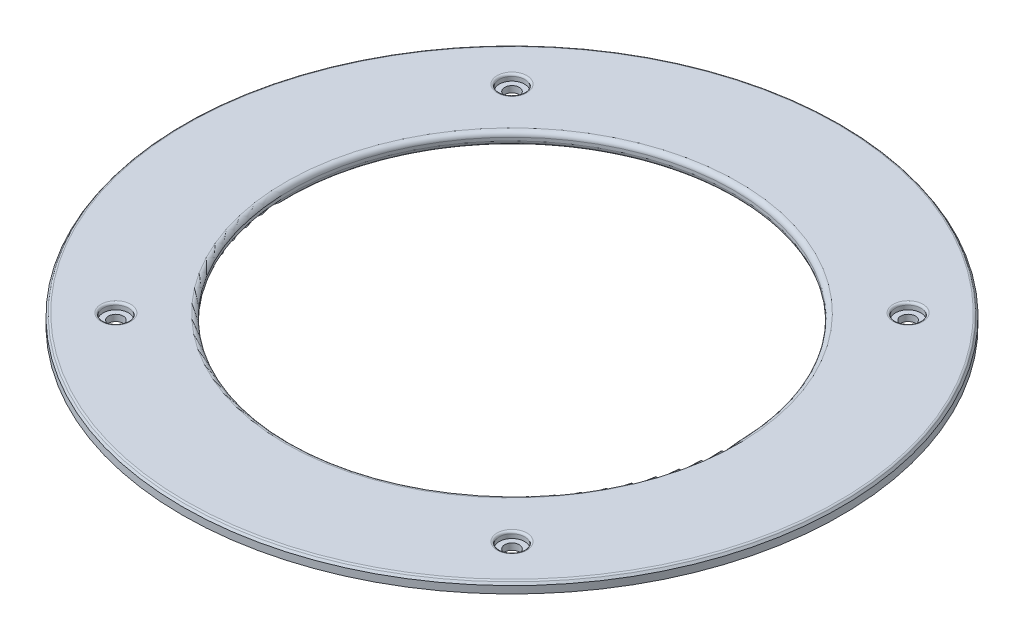
ISO-10303-21;
HEADER;
FILE_DESCRIPTION(('STEP AP214'),'2;1');
FILE_NAME('part.step','',(''),(''),'','','');
FILE_SCHEMA(('AUTOMOTIVE_DESIGN { 1 0 10303 214 1 1 1 1 }'));
ENDSEC;
DATA;
#1=APPLICATION_CONTEXT('core data for automotive mechanical design processes');
#2=APPLICATION_PROTOCOL_DEFINITION('international standard','automotive_design',2000,#1);
#3=PRODUCT_CONTEXT('',#1,'mechanical');
#4=PRODUCT('Part','Part','',(#3));
#5=PRODUCT_RELATED_PRODUCT_CATEGORY('part','',(#4));
#6=PRODUCT_DEFINITION_FORMATION('','',#4);
#7=PRODUCT_DEFINITION_CONTEXT('part definition',#1,'design');
#8=PRODUCT_DEFINITION('design','',#6,#7);
#9=PRODUCT_DEFINITION_SHAPE('','',#8);
#10=(LENGTH_UNIT() NAMED_UNIT(*) SI_UNIT(.MILLI.,.METRE.));
#11=(NAMED_UNIT(*) PLANE_ANGLE_UNIT() SI_UNIT($,.RADIAN.));
#12=(NAMED_UNIT(*) SI_UNIT($,.STERADIAN.) SOLID_ANGLE_UNIT());
#13=UNCERTAINTY_MEASURE_WITH_UNIT(LENGTH_MEASURE(1.E-05),#10,'distance_accuracy_value','');
#14=(GEOMETRIC_REPRESENTATION_CONTEXT(3) GLOBAL_UNCERTAINTY_ASSIGNED_CONTEXT((#13)) GLOBAL_UNIT_ASSIGNED_CONTEXT((#10,
#11,#12)) REPRESENTATION_CONTEXT('',''));
#15=CARTESIAN_POINT('',(0.,0.,0.));
#16=DIRECTION('',(0.,0.,1.));
#17=DIRECTION('',(1.,0.,0.));
#18=AXIS2_PLACEMENT_3D('',#15,#16,#17);
#19=CARTESIAN_POINT('',(0.,4.,0.));
#20=DIRECTION('',(0.,-1.,0.));
#21=DIRECTION('',(0.,0.,-1.));
#22=AXIS2_PLACEMENT_3D('',#19,#20,#21);
#23=CYLINDRICAL_SURFACE('',#22,104.);
#24=CARTESIAN_POINT('',(0.,0.700207538209707,0.));
#25=DIRECTION('',(0.,1.,0.));
#26=DIRECTION('',(0.,0.,1.));
#27=AXIS2_PLACEMENT_3D('',#24,#25,#26);
#28=CIRCLE('',#27,104.);
#29=CARTESIAN_POINT('',(0.,0.700207538209707,104.));
#30=VERTEX_POINT('',#29);
#31=EDGE_CURVE('E89',#30,#30,#28,.T.);
#32=ORIENTED_EDGE('',*,*,#31,.T.);
#33=EDGE_LOOP('',(#32));
#34=FACE_BOUND('',#33,.T.);
#35=CARTESIAN_POINT('',(0.,2.99999999999997,0.));
#36=DIRECTION('',(0.,1.,0.));
#37=DIRECTION('',(0.,0.,1.));
#38=AXIS2_PLACEMENT_3D('',#35,#36,#37);
#39=CIRCLE('',#38,104.);
#40=CARTESIAN_POINT('',(0.,2.99999999999997,104.));
#41=VERTEX_POINT('',#40);
#42=EDGE_CURVE('E92',#41,#41,#39,.F.);
#43=ORIENTED_EDGE('',*,*,#42,.T.);
#44=EDGE_LOOP('',(#43));
#45=FACE_BOUND('',#44,.T.);
#46=ADVANCED_FACE('F45',(#34,#45),#23,.T.);
#47=CARTESIAN_POINT('',(0.,4.,0.));
#48=DIRECTION('',(0.,1.,0.));
#49=DIRECTION('',(0.,0.,1.));
#50=AXIS2_PLACEMENT_3D('',#47,#48,#49);
#51=PLANE('',#50);
#52=CARTESIAN_POINT('',(0.,4.,0.));
#53=DIRECTION('',(0.,1.,0.));
#54=DIRECTION('',(0.,0.,1.));
#55=AXIS2_PLACEMENT_3D('',#52,#53,#54);
#56=CIRCLE('',#55,102.935395526404);
#57=CARTESIAN_POINT('',(0.,4.,102.935395526404));
#58=VERTEX_POINT('',#57);
#59=EDGE_CURVE('E52',#58,#58,#56,.T.);
#60=ORIENTED_EDGE('',*,*,#59,.T.);
#61=EDGE_LOOP('',(#60));
#62=FACE_BOUND('',#61,.T.);
#63=CARTESIAN_POINT('',(-62.5,4.,62.5));
#64=DIRECTION('',(0.,1.,0.));
#65=DIRECTION('',(0.,0.,1.));
#66=AXIS2_PLACEMENT_3D('',#63,#64,#65);
#67=CIRCLE('',#66,4.7);
#68=CARTESIAN_POINT('',(-62.5,4.,67.2));
#69=VERTEX_POINT('',#68);
#70=EDGE_CURVE('E74',#69,#69,#67,.F.);
#71=ORIENTED_EDGE('',*,*,#70,.T.);
#72=EDGE_LOOP('',(#71));
#73=FACE_BOUND('',#72,.T.);
#74=CARTESIAN_POINT('',(-62.5,4.,-62.5));
#75=DIRECTION('',(0.,1.,0.));
#76=DIRECTION('',(0.,0.,1.));
#77=AXIS2_PLACEMENT_3D('',#74,#75,#76);
#78=CIRCLE('',#77,4.7);
#79=CARTESIAN_POINT('',(-62.5,4.,-57.8));
#80=VERTEX_POINT('',#79);
#81=EDGE_CURVE('E77',#80,#80,#78,.F.);
#82=ORIENTED_EDGE('',*,*,#81,.T.);
#83=EDGE_LOOP('',(#82));
#84=FACE_BOUND('',#83,.T.);
#85=CARTESIAN_POINT('',(62.5,4.,-62.5));
#86=DIRECTION('',(0.,1.,0.));
#87=DIRECTION('',(0.,0.,1.));
#88=AXIS2_PLACEMENT_3D('',#85,#86,#87);
#89=CIRCLE('',#88,4.7);
#90=CARTESIAN_POINT('',(62.5,4.,-57.8));
#91=VERTEX_POINT('',#90);
#92=EDGE_CURVE('E80',#91,#91,#89,.F.);
#93=ORIENTED_EDGE('',*,*,#92,.T.);
#94=EDGE_LOOP('',(#93));
#95=FACE_BOUND('',#94,.T.);
#96=CARTESIAN_POINT('',(62.5,4.,62.5));
#97=DIRECTION('',(0.,1.,0.));
#98=DIRECTION('',(0.,0.,1.));
#99=AXIS2_PLACEMENT_3D('',#96,#97,#98);
#100=CIRCLE('',#99,4.7);
#101=CARTESIAN_POINT('',(62.5,4.,67.2));
#102=VERTEX_POINT('',#101);
#103=EDGE_CURVE('E83',#102,#102,#100,.F.);
#104=ORIENTED_EDGE('',*,*,#103,.T.);
#105=EDGE_LOOP('',(#104));
#106=FACE_BOUND('',#105,.T.);
#107=CARTESIAN_POINT('',(0.,4.,0.));
#108=DIRECTION('',(0.,1.,0.));
#109=DIRECTION('',(0.,0.,1.));
#110=AXIS2_PLACEMENT_3D('',#107,#108,#109);
#111=CIRCLE('',#110,71.5);
#112=CARTESIAN_POINT('',(0.,4.,71.5000000000001));
#113=VERTEX_POINT('',#112);
#114=EDGE_CURVE('E98',#113,#113,#111,.F.);
#115=ORIENTED_EDGE('',*,*,#114,.T.);
#116=EDGE_LOOP('',(#115));
#117=FACE_BOUND('',#116,.T.);
#118=ADVANCED_FACE('F164',(#62,#73,#84,#95,#106,#117),#51,.T.);
#119=CARTESIAN_POINT('',(0.,0.,0.));
#120=DIRECTION('',(0.,1.,0.));
#121=DIRECTION('',(0.,0.,1.));
#122=AXIS2_PLACEMENT_3D('',#119,#120,#121);
#123=PLANE('',#122);
#124=CARTESIAN_POINT('',(0.,0.,0.));
#125=DIRECTION('',(0.,1.,0.));
#126=DIRECTION('',(0.,0.,1.));
#127=AXIS2_PLACEMENT_3D('',#124,#125,#126);
#128=CIRCLE('',#127,102.779290847785);
#129=CARTESIAN_POINT('',(0.,0.,102.779290847785));
#130=VERTEX_POINT('',#129);
#131=EDGE_CURVE('E60',#130,#130,#128,.F.);
#132=ORIENTED_EDGE('',*,*,#131,.T.);
#133=EDGE_LOOP('',(#132));
#134=FACE_BOUND('',#133,.T.);
#135=CARTESIAN_POINT('',(0.,0.,0.));
#136=DIRECTION('',(0.,1.,0.));
#137=DIRECTION('',(0.,0.,1.));
#138=AXIS2_PLACEMENT_3D('',#135,#136,#137);
#139=CIRCLE('',#138,71.5);
#140=CARTESIAN_POINT('',(0.,0.,71.5000000000001));
#141=VERTEX_POINT('',#140);
#142=EDGE_CURVE('E95',#141,#141,#139,.T.);
#143=ORIENTED_EDGE('',*,*,#142,.T.);
#144=EDGE_LOOP('',(#143));
#145=FACE_BOUND('',#144,.T.);
#146=CARTESIAN_POINT('',(-62.5,0.,-62.5));
#147=DIRECTION('',(0.,1.,0.));
#148=DIRECTION('',(0.,0.,1.));
#149=AXIS2_PLACEMENT_3D('',#146,#147,#148);
#150=CIRCLE('',#149,2.3);
#151=CARTESIAN_POINT('',(-62.5,0.,-60.2));
#152=VERTEX_POINT('',#151);
#153=EDGE_CURVE('E134',#152,#152,#150,.T.);
#154=ORIENTED_EDGE('',*,*,#153,.T.);
#155=EDGE_LOOP('',(#154));
#156=FACE_BOUND('',#155,.T.);
#157=CARTESIAN_POINT('',(62.5,0.,-62.5));
#158=DIRECTION('',(0.,1.,0.));
#159=DIRECTION('',(0.,0.,1.));
#160=AXIS2_PLACEMENT_3D('',#157,#158,#159);
#161=CIRCLE('',#160,2.3);
#162=CARTESIAN_POINT('',(62.5,0.,-60.2));
#163=VERTEX_POINT('',#162);
#164=EDGE_CURVE('E125',#163,#163,#161,.T.);
#165=ORIENTED_EDGE('',*,*,#164,.T.);
#166=EDGE_LOOP('',(#165));
#167=FACE_BOUND('',#166,.T.);
#168=CARTESIAN_POINT('',(62.5,0.,62.5));
#169=DIRECTION('',(0.,1.,0.));
#170=DIRECTION('',(0.,0.,1.));
#171=AXIS2_PLACEMENT_3D('',#168,#169,#170);
#172=CIRCLE('',#171,2.3);
#173=CARTESIAN_POINT('',(62.5,0.,64.8));
#174=VERTEX_POINT('',#173);
#175=EDGE_CURVE('E116',#174,#174,#172,.T.);
#176=ORIENTED_EDGE('',*,*,#175,.T.);
#177=EDGE_LOOP('',(#176));
#178=FACE_BOUND('',#177,.T.);
#179=CARTESIAN_POINT('',(-62.5,0.,62.5));
#180=DIRECTION('',(0.,1.,0.));
#181=DIRECTION('',(0.,0.,1.));
#182=AXIS2_PLACEMENT_3D('',#179,#180,#181);
#183=CIRCLE('',#182,2.3);
#184=CARTESIAN_POINT('',(-62.5,0.,64.8));
#185=VERTEX_POINT('',#184);
#186=EDGE_CURVE('E107',#185,#185,#183,.T.);
#187=ORIENTED_EDGE('',*,*,#186,.T.);
#188=EDGE_LOOP('',(#187));
#189=FACE_BOUND('',#188,.T.);
#190=ADVANCED_FACE('F172',(#134,#145,#156,#167,#178,#189),#123,.F.);
#191=CARTESIAN_POINT('',(-62.5,4.,62.5));
#192=DIRECTION('',(0.,1.,0.));
#193=DIRECTION('',(0.,0.,1.));
#194=AXIS2_PLACEMENT_3D('',#191,#192,#193);
#195=CYLINDRICAL_SURFACE('',#194,2.3);
#196=ORIENTED_EDGE('',*,*,#186,.F.);
#197=EDGE_LOOP('',(#196));
#198=FACE_BOUND('',#197,.T.);
#199=CARTESIAN_POINT('',(-62.5,2.,62.5));
#200=DIRECTION('',(0.,1.,0.));
#201=DIRECTION('',(0.,0.,1.));
#202=AXIS2_PLACEMENT_3D('',#199,#200,#201);
#203=CIRCLE('',#202,2.3);
#204=CARTESIAN_POINT('',(-62.5,2.,64.8));
#205=VERTEX_POINT('',#204);
#206=EDGE_CURVE('E110',#205,#205,#203,.T.);
#207=ORIENTED_EDGE('',*,*,#206,.T.);
#208=EDGE_LOOP('',(#207));
#209=FACE_BOUND('',#208,.T.);
#210=ADVANCED_FACE('F223',(#198,#209),#195,.F.);
#211=CARTESIAN_POINT('',(-60.2,2.,62.5));
#212=DIRECTION('',(0.,-1.,0.));
#213=DIRECTION('',(0.,0.,-1.));
#214=AXIS2_PLACEMENT_3D('',#211,#212,#213);
#215=PLANE('',#214);
#216=ORIENTED_EDGE('',*,*,#206,.F.);
#217=EDGE_LOOP('',(#216));
#218=FACE_BOUND('',#217,.T.);
#219=CARTESIAN_POINT('',(-62.5,2.,62.5));
#220=DIRECTION('',(0.,1.,0.));
#221=DIRECTION('',(0.,0.,1.));
#222=AXIS2_PLACEMENT_3D('',#219,#220,#221);
#223=CIRCLE('',#222,4.);
#224=CARTESIAN_POINT('',(-62.5,2.,66.5));
#225=VERTEX_POINT('',#224);
#226=EDGE_CURVE('E113',#225,#225,#223,.T.);
#227=ORIENTED_EDGE('',*,*,#226,.T.);
#228=EDGE_LOOP('',(#227));
#229=FACE_BOUND('',#228,.T.);
#230=ADVANCED_FACE('F236',(#218,#229),#215,.F.);
#231=CARTESIAN_POINT('',(-62.5,4.,62.5));
#232=DIRECTION('',(0.,1.,0.));
#233=DIRECTION('',(0.,0.,1.));
#234=AXIS2_PLACEMENT_3D('',#231,#232,#233);
#235=CYLINDRICAL_SURFACE('',#234,4.);
#236=CARTESIAN_POINT('',(-62.5,3.3,62.5));
#237=DIRECTION('',(0.,1.,0.));
#238=DIRECTION('',(0.,0.,1.));
#239=AXIS2_PLACEMENT_3D('',#236,#237,#238);
#240=CIRCLE('',#239,4.);
#241=CARTESIAN_POINT('',(-62.5,3.3,66.5));
#242=VERTEX_POINT('',#241);
#243=EDGE_CURVE('E86',#242,#242,#240,.T.);
#244=ORIENTED_EDGE('',*,*,#243,.T.);
#245=EDGE_LOOP('',(#244));
#246=FACE_BOUND('',#245,.T.);
#247=ORIENTED_EDGE('',*,*,#226,.F.);
#248=EDGE_LOOP('',(#247));
#249=FACE_BOUND('',#248,.T.);
#250=ADVANCED_FACE('F242',(#246,#249),#235,.F.);
#251=CARTESIAN_POINT('',(62.5,4.,62.5));
#252=DIRECTION('',(0.,1.,0.));
#253=DIRECTION('',(0.,0.,1.));
#254=AXIS2_PLACEMENT_3D('',#251,#252,#253);
#255=CYLINDRICAL_SURFACE('',#254,2.3);
#256=ORIENTED_EDGE('',*,*,#175,.F.);
#257=EDGE_LOOP('',(#256));
#258=FACE_BOUND('',#257,.T.);
#259=CARTESIAN_POINT('',(62.5,2.,62.5));
#260=DIRECTION('',(0.,1.,0.));
#261=DIRECTION('',(0.,0.,1.));
#262=AXIS2_PLACEMENT_3D('',#259,#260,#261);
#263=CIRCLE('',#262,2.3);
#264=CARTESIAN_POINT('',(62.5,2.,64.8));
#265=VERTEX_POINT('',#264);
#266=EDGE_CURVE('E119',#265,#265,#263,.T.);
#267=ORIENTED_EDGE('',*,*,#266,.T.);
#268=EDGE_LOOP('',(#267));
#269=FACE_BOUND('',#268,.T.);
#270=ADVANCED_FACE('F246',(#258,#269),#255,.F.);
#271=CARTESIAN_POINT('',(64.8,2.,62.5));
#272=DIRECTION('',(0.,-1.,0.));
#273=DIRECTION('',(0.,0.,-1.));
#274=AXIS2_PLACEMENT_3D('',#271,#272,#273);
#275=PLANE('',#274);
#276=ORIENTED_EDGE('',*,*,#266,.F.);
#277=EDGE_LOOP('',(#276));
#278=FACE_BOUND('',#277,.T.);
#279=CARTESIAN_POINT('',(62.5,2.,62.5));
#280=DIRECTION('',(0.,1.,0.));
#281=DIRECTION('',(0.,0.,1.));
#282=AXIS2_PLACEMENT_3D('',#279,#280,#281);
#283=CIRCLE('',#282,4.);
#284=CARTESIAN_POINT('',(62.5,2.,66.5));
#285=VERTEX_POINT('',#284);
#286=EDGE_CURVE('E122',#285,#285,#283,.T.);
#287=ORIENTED_EDGE('',*,*,#286,.T.);
#288=EDGE_LOOP('',(#287));
#289=FACE_BOUND('',#288,.T.);
#290=ADVANCED_FACE('F253',(#278,#289),#275,.F.);
#291=CARTESIAN_POINT('',(62.5,4.,62.5));
#292=DIRECTION('',(0.,1.,0.));
#293=DIRECTION('',(0.,0.,1.));
#294=AXIS2_PLACEMENT_3D('',#291,#292,#293);
#295=CYLINDRICAL_SURFACE('',#294,4.);
#296=CARTESIAN_POINT('',(62.5,3.3,62.5));
#297=DIRECTION('',(0.,1.,0.));
#298=DIRECTION('',(0.,0.,1.));
#299=AXIS2_PLACEMENT_3D('',#296,#297,#298);
#300=CIRCLE('',#299,4.);
#301=CARTESIAN_POINT('',(62.5,3.3,66.5));
#302=VERTEX_POINT('',#301);
#303=EDGE_CURVE('E65',#302,#302,#300,.T.);
#304=ORIENTED_EDGE('',*,*,#303,.T.);
#305=EDGE_LOOP('',(#304));
#306=FACE_BOUND('',#305,.T.);
#307=ORIENTED_EDGE('',*,*,#286,.F.);
#308=EDGE_LOOP('',(#307));
#309=FACE_BOUND('',#308,.T.);
#310=ADVANCED_FACE('F259',(#306,#309),#295,.F.);
#311=CARTESIAN_POINT('',(62.5,4.,-62.5));
#312=DIRECTION('',(0.,1.,0.));
#313=DIRECTION('',(0.,0.,1.));
#314=AXIS2_PLACEMENT_3D('',#311,#312,#313);
#315=CYLINDRICAL_SURFACE('',#314,2.3);
#316=ORIENTED_EDGE('',*,*,#164,.F.);
#317=EDGE_LOOP('',(#316));
#318=FACE_BOUND('',#317,.T.);
#319=CARTESIAN_POINT('',(62.5,2.,-62.5));
#320=DIRECTION('',(0.,1.,0.));
#321=DIRECTION('',(0.,0.,1.));
#322=AXIS2_PLACEMENT_3D('',#319,#320,#321);
#323=CIRCLE('',#322,2.3);
#324=CARTESIAN_POINT('',(62.5,2.,-60.2));
#325=VERTEX_POINT('',#324);
#326=EDGE_CURVE('E128',#325,#325,#323,.T.);
#327=ORIENTED_EDGE('',*,*,#326,.T.);
#328=EDGE_LOOP('',(#327));
#329=FACE_BOUND('',#328,.T.);
#330=ADVANCED_FACE('F262',(#318,#329),#315,.F.);
#331=CARTESIAN_POINT('',(64.8,2.,-62.5));
#332=DIRECTION('',(0.,-1.,0.));
#333=DIRECTION('',(0.,0.,-1.));
#334=AXIS2_PLACEMENT_3D('',#331,#332,#333);
#335=PLANE('',#334);
#336=ORIENTED_EDGE('',*,*,#326,.F.);
#337=EDGE_LOOP('',(#336));
#338=FACE_BOUND('',#337,.T.);
#339=CARTESIAN_POINT('',(62.5,2.,-62.5));
#340=DIRECTION('',(0.,1.,0.));
#341=DIRECTION('',(0.,0.,1.));
#342=AXIS2_PLACEMENT_3D('',#339,#340,#341);
#343=CIRCLE('',#342,4.);
#344=CARTESIAN_POINT('',(62.5,2.,-58.5));
#345=VERTEX_POINT('',#344);
#346=EDGE_CURVE('E131',#345,#345,#343,.T.);
#347=ORIENTED_EDGE('',*,*,#346,.T.);
#348=EDGE_LOOP('',(#347));
#349=FACE_BOUND('',#348,.T.);
#350=ADVANCED_FACE('F266',(#338,#349),#335,.F.);
#351=CARTESIAN_POINT('',(62.5,4.,-62.5));
#352=DIRECTION('',(0.,1.,0.));
#353=DIRECTION('',(0.,0.,1.));
#354=AXIS2_PLACEMENT_3D('',#351,#352,#353);
#355=CYLINDRICAL_SURFACE('',#354,4.);
#356=CARTESIAN_POINT('',(62.5,3.3,-62.5));
#357=DIRECTION('',(0.,1.,0.));
#358=DIRECTION('',(0.,0.,1.));
#359=AXIS2_PLACEMENT_3D('',#356,#357,#358);
#360=CIRCLE('',#359,4.);
#361=CARTESIAN_POINT('',(62.5,3.3,-58.5));
#362=VERTEX_POINT('',#361);
#363=EDGE_CURVE('E68',#362,#362,#360,.T.);
#364=ORIENTED_EDGE('',*,*,#363,.T.);
#365=EDGE_LOOP('',(#364));
#366=FACE_BOUND('',#365,.T.);
#367=ORIENTED_EDGE('',*,*,#346,.F.);
#368=EDGE_LOOP('',(#367));
#369=FACE_BOUND('',#368,.T.);
#370=ADVANCED_FACE('F270',(#366,#369),#355,.F.);
#371=CARTESIAN_POINT('',(-62.5,4.,-62.5));
#372=DIRECTION('',(0.,1.,0.));
#373=DIRECTION('',(0.,0.,1.));
#374=AXIS2_PLACEMENT_3D('',#371,#372,#373);
#375=CYLINDRICAL_SURFACE('',#374,2.3);
#376=ORIENTED_EDGE('',*,*,#153,.F.);
#377=EDGE_LOOP('',(#376));
#378=FACE_BOUND('',#377,.T.);
#379=CARTESIAN_POINT('',(-62.5,2.,-62.5));
#380=DIRECTION('',(0.,1.,0.));
#381=DIRECTION('',(0.,0.,1.));
#382=AXIS2_PLACEMENT_3D('',#379,#380,#381);
#383=CIRCLE('',#382,2.3);
#384=CARTESIAN_POINT('',(-62.5,2.,-60.2));
#385=VERTEX_POINT('',#384);
#386=EDGE_CURVE('E137',#385,#385,#383,.T.);
#387=ORIENTED_EDGE('',*,*,#386,.T.);
#388=EDGE_LOOP('',(#387));
#389=FACE_BOUND('',#388,.T.);
#390=ADVANCED_FACE('F160',(#378,#389),#375,.F.);
#391=CARTESIAN_POINT('',(-60.2,2.,-62.5));
#392=DIRECTION('',(0.,-1.,0.));
#393=DIRECTION('',(0.,0.,-1.));
#394=AXIS2_PLACEMENT_3D('',#391,#392,#393);
#395=PLANE('',#394);
#396=ORIENTED_EDGE('',*,*,#386,.F.);
#397=EDGE_LOOP('',(#396));
#398=FACE_BOUND('',#397,.T.);
#399=CARTESIAN_POINT('',(-62.5,2.,-62.5));
#400=DIRECTION('',(0.,1.,0.));
#401=DIRECTION('',(0.,0.,1.));
#402=AXIS2_PLACEMENT_3D('',#399,#400,#401);
#403=CIRCLE('',#402,4.);
#404=CARTESIAN_POINT('',(-62.5,2.,-58.5));
#405=VERTEX_POINT('',#404);
#406=EDGE_CURVE('E140',#405,#405,#403,.T.);
#407=ORIENTED_EDGE('',*,*,#406,.T.);
#408=EDGE_LOOP('',(#407));
#409=FACE_BOUND('',#408,.T.);
#410=ADVANCED_FACE('F144',(#398,#409),#395,.F.);
#411=CARTESIAN_POINT('',(-62.5,4.,-62.5));
#412=DIRECTION('',(0.,1.,0.));
#413=DIRECTION('',(0.,0.,1.));
#414=AXIS2_PLACEMENT_3D('',#411,#412,#413);
#415=CYLINDRICAL_SURFACE('',#414,4.);
#416=CARTESIAN_POINT('',(-62.5,3.3,-62.5));
#417=DIRECTION('',(0.,1.,0.));
#418=DIRECTION('',(0.,0.,1.));
#419=AXIS2_PLACEMENT_3D('',#416,#417,#418);
#420=CIRCLE('',#419,4.);
#421=CARTESIAN_POINT('',(-62.5,3.3,-58.5));
#422=VERTEX_POINT('',#421);
#423=EDGE_CURVE('E71',#422,#422,#420,.T.);
#424=ORIENTED_EDGE('',*,*,#423,.T.);
#425=EDGE_LOOP('',(#424));
#426=FACE_BOUND('',#425,.T.);
#427=ORIENTED_EDGE('',*,*,#406,.F.);
#428=EDGE_LOOP('',(#427));
#429=FACE_BOUND('',#428,.T.);
#430=ADVANCED_FACE('F146',(#426,#429),#415,.F.);
#431=CARTESIAN_POINT('',(0.,0.,0.));
#432=DIRECTION('',(0.,1.,0.));
#433=DIRECTION('',(0.,0.,1.));
#434=AXIS2_PLACEMENT_3D('',#431,#432,#433);
#435=CYLINDRICAL_SURFACE('',#434,70.);
#436=CARTESIAN_POINT('',(0.,2.5,0.));
#437=DIRECTION('',(0.,1.,0.));
#438=DIRECTION('',(0.,0.,1.));
#439=AXIS2_PLACEMENT_3D('',#436,#437,#438);
#440=CIRCLE('',#439,70.);
#441=CARTESIAN_POINT('',(0.,2.5,70.0000000000001));
#442=VERTEX_POINT('',#441);
#443=EDGE_CURVE('E101',#442,#442,#440,.T.);
#444=ORIENTED_EDGE('',*,*,#443,.T.);
#445=EDGE_LOOP('',(#444));
#446=FACE_BOUND('',#445,.T.);
#447=CARTESIAN_POINT('',(0.,1.5,0.));
#448=DIRECTION('',(0.,1.,0.));
#449=DIRECTION('',(0.,0.,1.));
#450=AXIS2_PLACEMENT_3D('',#447,#448,#449);
#451=CIRCLE('',#450,70.);
#452=CARTESIAN_POINT('',(0.,1.5,70.0000000000001));
#453=VERTEX_POINT('',#452);
#454=EDGE_CURVE('E104',#453,#453,#451,.F.);
#455=ORIENTED_EDGE('',*,*,#454,.T.);
#456=EDGE_LOOP('',(#455));
#457=FACE_BOUND('',#456,.T.);
#458=ADVANCED_FACE('F148',(#446,#457),#435,.F.);
#459=CARTESIAN_POINT('',(0.,2.5,0.));
#460=DIRECTION('',(0.,1.,0.));
#461=DIRECTION('',(0.,0.,1.));
#462=AXIS2_PLACEMENT_3D('',#459,#460,#461);
#463=TOROIDAL_SURFACE('',#462,71.5,1.5);
#464=ORIENTED_EDGE('',*,*,#114,.F.);
#465=EDGE_LOOP('',(#464));
#466=FACE_BOUND('',#465,.T.);
#467=ORIENTED_EDGE('',*,*,#443,.F.);
#468=EDGE_LOOP('',(#467));
#469=FACE_BOUND('',#468,.T.);
#470=ADVANCED_FACE('F156',(#466,#469),#463,.T.);
#471=CARTESIAN_POINT('',(0.,1.5,0.));
#472=DIRECTION('',(0.,1.,0.));
#473=DIRECTION('',(0.,0.,1.));
#474=AXIS2_PLACEMENT_3D('',#471,#472,#473);
#475=TOROIDAL_SURFACE('',#474,71.5,1.5);
#476=ORIENTED_EDGE('',*,*,#454,.F.);
#477=EDGE_LOOP('',(#476));
#478=FACE_BOUND('',#477,.T.);
#479=ORIENTED_EDGE('',*,*,#142,.F.);
#480=EDGE_LOOP('',(#479));
#481=FACE_BOUND('',#480,.T.);
#482=ADVANCED_FACE('F179',(#478,#481),#475,.T.);
#483=CARTESIAN_POINT('',(0.,0.700207538209707,0.));
#484=DIRECTION('',(0.,1.,0.));
#485=DIRECTION('',(0.,0.,1.));
#486=AXIS2_PLACEMENT_3D('',#483,#484,#485);
#487=CONICAL_SURFACE('',#486,104.,0.959931088596903);
#488=CARTESIAN_POINT('',(0.,0.126593568997663,0.));
#489=DIRECTION('',(0.,1.,0.));
#490=DIRECTION('',(0.,0.,1.));
#491=AXIS2_PLACEMENT_3D('',#488,#489,#490);
#492=CIRCLE('',#491,103.18079435323);
#493=CARTESIAN_POINT('',(0.,0.126593568997663,103.18079435323));
#494=VERTEX_POINT('',#493);
#495=EDGE_CURVE('E56',#494,#494,#492,.T.);
#496=ORIENTED_EDGE('',*,*,#495,.T.);
#497=EDGE_LOOP('',(#496));
#498=FACE_BOUND('',#497,.T.);
#499=ORIENTED_EDGE('',*,*,#31,.F.);
#500=EDGE_LOOP('',(#499));
#501=FACE_BOUND('',#500,.T.);
#502=ADVANCED_FACE('F182',(#498,#501),#487,.T.);
#503=CARTESIAN_POINT('',(0.,4.,0.));
#504=DIRECTION('',(0.,-1.,0.));
#505=DIRECTION('',(0.,0.,-1.));
#506=AXIS2_PLACEMENT_3D('',#503,#504,#505);
#507=CONICAL_SURFACE('',#506,103.29979246179,0.610865238197982);
#508=CARTESIAN_POINT('',(0.,3.70150350544571,0.));
#509=DIRECTION('',(0.,1.,0.));
#510=DIRECTION('',(0.,0.,1.));
#511=AXIS2_PLACEMENT_3D('',#508,#509,#510);
#512=CIRCLE('',#511,103.508801957406);
#513=CARTESIAN_POINT('',(0.,3.70150350544571,103.508801957406));
#514=VERTEX_POINT('',#513);
#515=EDGE_CURVE('E10',#514,#514,#512,.F.);
#516=ORIENTED_EDGE('',*,*,#515,.T.);
#517=EDGE_LOOP('',(#516));
#518=FACE_BOUND('',#517,.T.);
#519=ORIENTED_EDGE('',*,*,#42,.F.);
#520=EDGE_LOOP('',(#519));
#521=FACE_BOUND('',#520,.T.);
#522=ADVANCED_FACE('F190',(#518,#521),#507,.T.);
#523=CARTESIAN_POINT('',(-62.5,3.3,62.5));
#524=DIRECTION('',(0.,1.,0.));
#525=DIRECTION('',(0.,0.,1.));
#526=AXIS2_PLACEMENT_3D('',#523,#524,#525);
#527=TOROIDAL_SURFACE('',#526,4.7,0.7);
#528=ORIENTED_EDGE('',*,*,#70,.F.);
#529=EDGE_LOOP('',(#528));
#530=FACE_BOUND('',#529,.T.);
#531=ORIENTED_EDGE('',*,*,#243,.F.);
#532=EDGE_LOOP('',(#531));
#533=FACE_BOUND('',#532,.T.);
#534=ADVANCED_FACE('F196',(#530,#533),#527,.T.);
#535=CARTESIAN_POINT('',(-62.5,3.3,-62.5));
#536=DIRECTION('',(0.,1.,0.));
#537=DIRECTION('',(0.,0.,1.));
#538=AXIS2_PLACEMENT_3D('',#535,#536,#537);
#539=TOROIDAL_SURFACE('',#538,4.7,0.7);
#540=ORIENTED_EDGE('',*,*,#81,.F.);
#541=EDGE_LOOP('',(#540));
#542=FACE_BOUND('',#541,.T.);
#543=ORIENTED_EDGE('',*,*,#423,.F.);
#544=EDGE_LOOP('',(#543));
#545=FACE_BOUND('',#544,.T.);
#546=ADVANCED_FACE('F198',(#542,#545),#539,.T.);
#547=CARTESIAN_POINT('',(62.5,3.3,-62.5));
#548=DIRECTION('',(0.,1.,0.));
#549=DIRECTION('',(0.,0.,1.));
#550=AXIS2_PLACEMENT_3D('',#547,#548,#549);
#551=TOROIDAL_SURFACE('',#550,4.7,0.7);
#552=ORIENTED_EDGE('',*,*,#92,.F.);
#553=EDGE_LOOP('',(#552));
#554=FACE_BOUND('',#553,.T.);
#555=ORIENTED_EDGE('',*,*,#363,.F.);
#556=EDGE_LOOP('',(#555));
#557=FACE_BOUND('',#556,.T.);
#558=ADVANCED_FACE('F202',(#554,#557),#551,.T.);
#559=CARTESIAN_POINT('',(62.5,3.3,62.5));
#560=DIRECTION('',(0.,1.,0.));
#561=DIRECTION('',(0.,0.,1.));
#562=AXIS2_PLACEMENT_3D('',#559,#560,#561);
#563=TOROIDAL_SURFACE('',#562,4.7,0.7);
#564=ORIENTED_EDGE('',*,*,#103,.F.);
#565=EDGE_LOOP('',(#564));
#566=FACE_BOUND('',#565,.T.);
#567=ORIENTED_EDGE('',*,*,#303,.F.);
#568=EDGE_LOOP('',(#567));
#569=FACE_BOUND('',#568,.T.);
#570=ADVANCED_FACE('F206',(#566,#569),#563,.T.);
#571=CARTESIAN_POINT('',(0.,0.7,0.));
#572=DIRECTION('',(0.,1.,0.));
#573=DIRECTION('',(0.,0.,1.));
#574=AXIS2_PLACEMENT_3D('',#571,#572,#573);
#575=TOROIDAL_SURFACE('',#574,102.779290847785,0.7);
#576=ORIENTED_EDGE('',*,*,#495,.F.);
#577=EDGE_LOOP('',(#576));
#578=FACE_BOUND('',#577,.T.);
#579=ORIENTED_EDGE('',*,*,#131,.F.);
#580=EDGE_LOOP('',(#579));
#581=FACE_BOUND('',#580,.T.);
#582=ADVANCED_FACE('F209',(#578,#581),#575,.T.);
#583=CARTESIAN_POINT('',(0.,3.3,0.));
#584=DIRECTION('',(0.,1.,0.));
#585=DIRECTION('',(0.,0.,1.));
#586=AXIS2_PLACEMENT_3D('',#583,#584,#585);
#587=TOROIDAL_SURFACE('',#586,102.935395526404,0.7);
#588=ORIENTED_EDGE('',*,*,#515,.F.);
#589=EDGE_LOOP('',(#588));
#590=FACE_BOUND('',#589,.T.);
#591=ORIENTED_EDGE('',*,*,#59,.F.);
#592=EDGE_LOOP('',(#591));
#593=FACE_BOUND('',#592,.T.);
#594=ADVANCED_FACE('F47',(#590,#593),#587,.T.);
#595=CLOSED_SHELL('',(#46,#118,#190,#210,#230,#250,#270,#290,#310,#330,#350,#370,#390,#410,#430,
#458,#470,#482,#502,#522,#534,#546,#558,#570,#582,#594));
#596=MANIFOLD_SOLID_BREP('B2',#595);
#597=ADVANCED_BREP_SHAPE_REPRESENTATION('',(#18,#596),#14);
#598=SHAPE_DEFINITION_REPRESENTATION(#9,#597);
ENDSEC;
END-ISO-10303-21;
